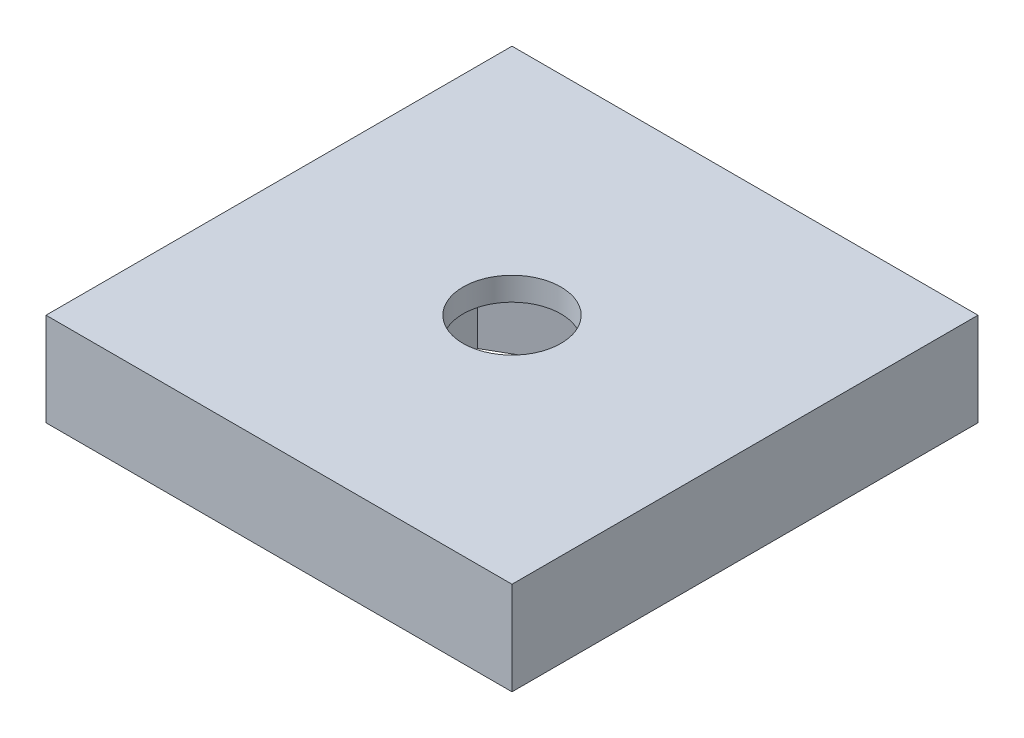
ISO-10303-21;
HEADER;
FILE_DESCRIPTION(('STEP AP214'),'2;1');
FILE_NAME('part.step','',(''),(''),'','','');
FILE_SCHEMA(('AUTOMOTIVE_DESIGN { 1 0 10303 214 1 1 1 1 }'));
ENDSEC;
DATA;
#1=APPLICATION_CONTEXT('core data for automotive mechanical design processes');
#2=APPLICATION_PROTOCOL_DEFINITION('international standard','automotive_design',2000,#1);
#3=PRODUCT_CONTEXT('',#1,'mechanical');
#4=PRODUCT('Part','Part','',(#3));
#5=PRODUCT_RELATED_PRODUCT_CATEGORY('part','',(#4));
#6=PRODUCT_DEFINITION_FORMATION('','',#4);
#7=PRODUCT_DEFINITION_CONTEXT('part definition',#1,'design');
#8=PRODUCT_DEFINITION('design','',#6,#7);
#9=PRODUCT_DEFINITION_SHAPE('','',#8);
#10=(LENGTH_UNIT() NAMED_UNIT(*) SI_UNIT(.MILLI.,.METRE.));
#11=(NAMED_UNIT(*) PLANE_ANGLE_UNIT() SI_UNIT($,.RADIAN.));
#12=(NAMED_UNIT(*) SI_UNIT($,.STERADIAN.) SOLID_ANGLE_UNIT());
#13=UNCERTAINTY_MEASURE_WITH_UNIT(LENGTH_MEASURE(1.E-05),#10,'distance_accuracy_value','');
#14=(GEOMETRIC_REPRESENTATION_CONTEXT(3) GLOBAL_UNCERTAINTY_ASSIGNED_CONTEXT((#13)) GLOBAL_UNIT_ASSIGNED_CONTEXT((#10,
#11,#12)) REPRESENTATION_CONTEXT('',''));
#15=CARTESIAN_POINT('',(0.,0.,0.));
#16=DIRECTION('',(0.,0.,1.));
#17=DIRECTION('',(1.,0.,0.));
#18=AXIS2_PLACEMENT_3D('',#15,#16,#17);
#19=CARTESIAN_POINT('',(0.,0.,0.));
#20=DIRECTION('',(0.,-1.,0.));
#21=DIRECTION('',(0.,0.,-1.));
#22=AXIS2_PLACEMENT_3D('',#19,#20,#21);
#23=PLANE('',#22);
#24=DIRECTION('',(0.,0.,-1.));
#25=VECTOR('',#24,1.);
#26=CARTESIAN_POINT('',(-10.,0.,10.));
#27=LINE('',#26,#25);
#28=CARTESIAN_POINT('',(-10.,0.,10.));
#29=VERTEX_POINT('',#28);
#30=CARTESIAN_POINT('',(-10.,0.,-10.));
#31=VERTEX_POINT('',#30);
#32=EDGE_CURVE('E149',#29,#31,#27,.T.);
#33=ORIENTED_EDGE('',*,*,#32,.T.);
#34=DIRECTION('',(1.,0.,0.));
#35=VECTOR('',#34,1.);
#36=CARTESIAN_POINT('',(-10.,0.,-10.));
#37=LINE('',#36,#35);
#38=CARTESIAN_POINT('',(10.,0.,-10.));
#39=VERTEX_POINT('',#38);
#40=EDGE_CURVE('E155',#31,#39,#37,.T.);
#41=ORIENTED_EDGE('',*,*,#40,.T.);
#42=DIRECTION('',(0.,0.,-1.));
#43=VECTOR('',#42,1.);
#44=CARTESIAN_POINT('',(10.,0.,10.));
#45=LINE('',#44,#43);
#46=CARTESIAN_POINT('',(10.,0.,10.));
#47=VERTEX_POINT('',#46);
#48=EDGE_CURVE('E177',#47,#39,#45,.T.);
#49=ORIENTED_EDGE('',*,*,#48,.F.);
#50=DIRECTION('',(1.,0.,0.));
#51=VECTOR('',#50,1.);
#52=CARTESIAN_POINT('',(-10.,0.,10.));
#53=LINE('',#52,#51);
#54=EDGE_CURVE('E165',#29,#47,#53,.T.);
#55=ORIENTED_EDGE('',*,*,#54,.F.);
#56=EDGE_LOOP('',(#33,#41,#49,#55));
#57=FACE_BOUND('',#56,.T.);
#58=DIRECTION('',(0.,0.,1.));
#59=VECTOR('',#58,1.);
#60=CARTESIAN_POINT('',(-3.50000000000001,0.,-2.02072594216368));
#61=LINE('',#60,#59);
#62=CARTESIAN_POINT('',(-3.50000000000001,0.,-2.02072594216368));
#63=VERTEX_POINT('',#62);
#64=CARTESIAN_POINT('',(-3.49999999999999,0.,2.02072594216371));
#65=VERTEX_POINT('',#64);
#66=EDGE_CURVE('E143',#63,#65,#61,.T.);
#67=ORIENTED_EDGE('',*,*,#66,.T.);
#68=DIRECTION('',(0.866025403784441,0.,0.499999999999995));
#69=VECTOR('',#68,1.);
#70=CARTESIAN_POINT('',(-3.49999999999999,0.,2.02072594216371));
#71=LINE('',#70,#69);
#72=CARTESIAN_POINT('',(0.,0.,4.04145188432738));
#73=VERTEX_POINT('',#72);
#74=EDGE_CURVE('E57',#65,#73,#71,.T.);
#75=ORIENTED_EDGE('',*,*,#74,.T.);
#76=DIRECTION('',(0.866025403784434,0.,-0.500000000000007));
#77=VECTOR('',#76,1.);
#78=CARTESIAN_POINT('',(0.,0.,4.04145188432738));
#79=LINE('',#78,#77);
#80=CARTESIAN_POINT('',(3.50000000000002,0.,2.02072594216366));
#81=VERTEX_POINT('',#80);
#82=EDGE_CURVE('E147',#73,#81,#79,.T.);
#83=ORIENTED_EDGE('',*,*,#82,.T.);
#84=DIRECTION('',(0.,0.,-1.));
#85=VECTOR('',#84,1.);
#86=CARTESIAN_POINT('',(3.50000000000002,0.,2.02072594216366));
#87=LINE('',#86,#85);
#88=CARTESIAN_POINT('',(3.49999999999998,0.,-2.02072594216373));
#89=VERTEX_POINT('',#88);
#90=EDGE_CURVE('E337',#81,#89,#87,.T.);
#91=ORIENTED_EDGE('',*,*,#90,.T.);
#92=DIRECTION('',(-0.866025403784442,0.,-0.499999999999995));
#93=VECTOR('',#92,1.);
#94=CARTESIAN_POINT('',(3.49999999999998,0.,-2.02072594216373));
#95=LINE('',#94,#93);
#96=CARTESIAN_POINT('',(0.,0.,-4.04145188432738));
#97=VERTEX_POINT('',#96);
#98=EDGE_CURVE('E341',#89,#97,#95,.T.);
#99=ORIENTED_EDGE('',*,*,#98,.T.);
#100=DIRECTION('',(-0.866025403784438,0.,0.500000000000001));
#101=VECTOR('',#100,1.);
#102=CARTESIAN_POINT('',(0.,0.,-4.04145188432738));
#103=LINE('',#102,#101);
#104=EDGE_CURVE('E345',#97,#63,#103,.T.);
#105=ORIENTED_EDGE('',*,*,#104,.T.);
#106=EDGE_LOOP('',(#67,#75,#83,#91,#99,#105));
#107=FACE_BOUND('',#106,.T.);
#108=ADVANCED_FACE('F39',(#57,#107),#23,.T.);
#109=CARTESIAN_POINT('',(-10.,4.,10.));
#110=DIRECTION('',(-1.,0.,0.));
#111=DIRECTION('',(0.,0.,1.));
#112=AXIS2_PLACEMENT_3D('',#109,#110,#111);
#113=PLANE('',#112);
#114=ORIENTED_EDGE('',*,*,#32,.F.);
#115=DIRECTION('',(0.,-1.,0.));
#116=VECTOR('',#115,1.);
#117=CARTESIAN_POINT('',(-10.,4.,10.));
#118=LINE('',#117,#116);
#119=CARTESIAN_POINT('',(-10.,4.,10.));
#120=VERTEX_POINT('',#119);
#121=EDGE_CURVE('E11',#120,#29,#118,.T.);
#122=ORIENTED_EDGE('',*,*,#121,.F.);
#123=DIRECTION('',(0.,0.,-1.));
#124=VECTOR('',#123,1.);
#125=CARTESIAN_POINT('',(-10.,4.,10.));
#126=LINE('',#125,#124);
#127=CARTESIAN_POINT('',(-10.,4.,-10.));
#128=VERTEX_POINT('',#127);
#129=EDGE_CURVE('E161',#120,#128,#126,.T.);
#130=ORIENTED_EDGE('',*,*,#129,.T.);
#131=DIRECTION('',(0.,-1.,0.));
#132=VECTOR('',#131,1.);
#133=CARTESIAN_POINT('',(-10.,4.,-10.));
#134=LINE('',#133,#132);
#135=EDGE_CURVE('E89',#128,#31,#134,.T.);
#136=ORIENTED_EDGE('',*,*,#135,.T.);
#137=EDGE_LOOP('',(#114,#122,#130,#136));
#138=FACE_BOUND('',#137,.T.);
#139=ADVANCED_FACE('F41',(#138),#113,.T.);
#140=CARTESIAN_POINT('',(-10.,4.,10.));
#141=DIRECTION('',(0.,0.,-1.));
#142=DIRECTION('',(-1.,0.,0.));
#143=AXIS2_PLACEMENT_3D('',#140,#141,#142);
#144=PLANE('',#143);
#145=ORIENTED_EDGE('',*,*,#54,.T.);
#146=DIRECTION('',(0.,-1.,0.));
#147=VECTOR('',#146,1.);
#148=CARTESIAN_POINT('',(10.,4.,10.));
#149=LINE('',#148,#147);
#150=CARTESIAN_POINT('',(10.,4.,10.));
#151=VERTEX_POINT('',#150);
#152=EDGE_CURVE('E49',#151,#47,#149,.T.);
#153=ORIENTED_EDGE('',*,*,#152,.F.);
#154=DIRECTION('',(1.,0.,0.));
#155=VECTOR('',#154,1.);
#156=CARTESIAN_POINT('',(-10.,4.,10.));
#157=LINE('',#156,#155);
#158=EDGE_CURVE('E171',#120,#151,#157,.T.);
#159=ORIENTED_EDGE('',*,*,#158,.F.);
#160=ORIENTED_EDGE('',*,*,#121,.T.);
#161=EDGE_LOOP('',(#145,#153,#159,#160));
#162=FACE_BOUND('',#161,.T.);
#163=ADVANCED_FACE('F196',(#162),#144,.F.);
#164=CARTESIAN_POINT('',(10.,4.,10.));
#165=DIRECTION('',(-1.,0.,0.));
#166=DIRECTION('',(0.,0.,1.));
#167=AXIS2_PLACEMENT_3D('',#164,#165,#166);
#168=PLANE('',#167);
#169=ORIENTED_EDGE('',*,*,#48,.T.);
#170=DIRECTION('',(0.,-1.,0.));
#171=VECTOR('',#170,1.);
#172=CARTESIAN_POINT('',(10.,4.,-10.));
#173=LINE('',#172,#171);
#174=CARTESIAN_POINT('',(10.,4.,-10.));
#175=VERTEX_POINT('',#174);
#176=EDGE_CURVE('E186',#175,#39,#173,.T.);
#177=ORIENTED_EDGE('',*,*,#176,.F.);
#178=DIRECTION('',(0.,0.,-1.));
#179=VECTOR('',#178,1.);
#180=CARTESIAN_POINT('',(10.,4.,10.));
#181=LINE('',#180,#179);
#182=EDGE_CURVE('E168',#151,#175,#181,.T.);
#183=ORIENTED_EDGE('',*,*,#182,.F.);
#184=ORIENTED_EDGE('',*,*,#152,.T.);
#185=EDGE_LOOP('',(#169,#177,#183,#184));
#186=FACE_BOUND('',#185,.T.);
#187=ADVANCED_FACE('F199',(#186),#168,.F.);
#188=CARTESIAN_POINT('',(-10.,4.,-10.));
#189=DIRECTION('',(0.,0.,-1.));
#190=DIRECTION('',(-1.,0.,0.));
#191=AXIS2_PLACEMENT_3D('',#188,#189,#190);
#192=PLANE('',#191);
#193=ORIENTED_EDGE('',*,*,#40,.F.);
#194=ORIENTED_EDGE('',*,*,#135,.F.);
#195=DIRECTION('',(1.,0.,0.));
#196=VECTOR('',#195,1.);
#197=CARTESIAN_POINT('',(-10.,4.,-10.));
#198=LINE('',#197,#196);
#199=EDGE_CURVE('E164',#128,#175,#198,.T.);
#200=ORIENTED_EDGE('',*,*,#199,.T.);
#201=ORIENTED_EDGE('',*,*,#176,.T.);
#202=EDGE_LOOP('',(#193,#194,#200,#201));
#203=FACE_BOUND('',#202,.T.);
#204=ADVANCED_FACE('F190',(#203),#192,.T.);
#205=CARTESIAN_POINT('',(0.,4.,0.));
#206=DIRECTION('',(0.,-1.,0.));
#207=DIRECTION('',(0.,0.,-1.));
#208=AXIS2_PLACEMENT_3D('',#205,#206,#207);
#209=PLANE('',#208);
#210=CARTESIAN_POINT('',(0.,4.,0.));
#211=DIRECTION('',(0.,1.,0.));
#212=DIRECTION('',(0.,0.,1.));
#213=AXIS2_PLACEMENT_3D('',#210,#211,#212);
#214=CIRCLE('',#213,2.1);
#215=CARTESIAN_POINT('',(0.,4.,2.1));
#216=VERTEX_POINT('',#215);
#217=EDGE_CURVE('E315',#216,#216,#214,.T.);
#218=ORIENTED_EDGE('',*,*,#217,.F.);
#219=EDGE_LOOP('',(#218));
#220=FACE_BOUND('',#219,.T.);
#221=ORIENTED_EDGE('',*,*,#129,.F.);
#222=ORIENTED_EDGE('',*,*,#158,.T.);
#223=ORIENTED_EDGE('',*,*,#182,.T.);
#224=ORIENTED_EDGE('',*,*,#199,.F.);
#225=EDGE_LOOP('',(#221,#222,#223,#224));
#226=FACE_BOUND('',#225,.T.);
#227=ADVANCED_FACE('F201',(#220,#226),#209,.F.);
#228=CARTESIAN_POINT('',(-3.49999999999999,3.,2.02072594216371));
#229=DIRECTION('',(0.499999999999995,0.,-0.866025403784442));
#230=DIRECTION('',(-0.866025403784442,0.,-0.499999999999995));
#231=AXIS2_PLACEMENT_3D('',#228,#229,#230);
#232=PLANE('',#231);
#233=ORIENTED_EDGE('',*,*,#74,.F.);
#234=DIRECTION('',(0.,-1.,0.));
#235=VECTOR('',#234,1.);
#236=CARTESIAN_POINT('',(-3.49999999999999,3.,2.02072594216371));
#237=LINE('',#236,#235);
#238=CARTESIAN_POINT('',(-3.49999999999999,3.,2.02072594216371));
#239=VERTEX_POINT('',#238);
#240=EDGE_CURVE('E141',#239,#65,#237,.T.);
#241=ORIENTED_EDGE('',*,*,#240,.F.);
#242=DIRECTION('',(0.866025403784441,0.,0.499999999999995));
#243=VECTOR('',#242,1.);
#244=CARTESIAN_POINT('',(-3.49999999999999,3.,2.02072594216371));
#245=LINE('',#244,#243);
#246=CARTESIAN_POINT('',(0.,3.,4.04145188432738));
#247=VERTEX_POINT('',#246);
#248=EDGE_CURVE('E131',#239,#247,#245,.T.);
#249=ORIENTED_EDGE('',*,*,#248,.T.);
#250=DIRECTION('',(0.,-1.,0.));
#251=VECTOR('',#250,1.);
#252=CARTESIAN_POINT('',(0.,3.,4.04145188432738));
#253=LINE('',#252,#251);
#254=EDGE_CURVE('E140',#247,#73,#253,.T.);
#255=ORIENTED_EDGE('',*,*,#254,.T.);
#256=EDGE_LOOP('',(#233,#241,#249,#255));
#257=FACE_BOUND('',#256,.T.);
#258=ADVANCED_FACE('F139',(#257),#232,.T.);
#259=CARTESIAN_POINT('',(0.,3.,4.04145188432738));
#260=DIRECTION('',(-0.500000000000007,0.,-0.866025403784435));
#261=DIRECTION('',(-0.866025403784434,0.,0.500000000000007));
#262=AXIS2_PLACEMENT_3D('',#259,#260,#261);
#263=PLANE('',#262);
#264=ORIENTED_EDGE('',*,*,#82,.F.);
#265=ORIENTED_EDGE('',*,*,#254,.F.);
#266=DIRECTION('',(0.866025403784434,0.,-0.500000000000007));
#267=VECTOR('',#266,1.);
#268=CARTESIAN_POINT('',(0.,3.,4.04145188432738));
#269=LINE('',#268,#267);
#270=CARTESIAN_POINT('',(3.50000000000002,3.,2.02072594216366));
#271=VERTEX_POINT('',#270);
#272=EDGE_CURVE('E127',#247,#271,#269,.T.);
#273=ORIENTED_EDGE('',*,*,#272,.T.);
#274=DIRECTION('',(0.,-1.,0.));
#275=VECTOR('',#274,1.);
#276=CARTESIAN_POINT('',(3.50000000000002,3.,2.02072594216366));
#277=LINE('',#276,#275);
#278=EDGE_CURVE('E150',#271,#81,#277,.T.);
#279=ORIENTED_EDGE('',*,*,#278,.T.);
#280=EDGE_LOOP('',(#264,#265,#273,#279));
#281=FACE_BOUND('',#280,.T.);
#282=ADVANCED_FACE('F145',(#281),#263,.T.);
#283=CARTESIAN_POINT('',(3.50000000000002,3.,2.02072594216366));
#284=DIRECTION('',(-1.,0.,0.));
#285=DIRECTION('',(0.,0.,1.));
#286=AXIS2_PLACEMENT_3D('',#283,#284,#285);
#287=PLANE('',#286);
#288=ORIENTED_EDGE('',*,*,#90,.F.);
#289=ORIENTED_EDGE('',*,*,#278,.F.);
#290=DIRECTION('',(0.,0.,-1.));
#291=VECTOR('',#290,1.);
#292=CARTESIAN_POINT('',(3.50000000000002,3.,2.02072594216366));
#293=LINE('',#292,#291);
#294=CARTESIAN_POINT('',(3.49999999999998,3.,-2.02072594216373));
#295=VERTEX_POINT('',#294);
#296=EDGE_CURVE('E133',#271,#295,#293,.T.);
#297=ORIENTED_EDGE('',*,*,#296,.T.);
#298=DIRECTION('',(0.,-1.,0.));
#299=VECTOR('',#298,1.);
#300=CARTESIAN_POINT('',(3.49999999999998,3.,-2.02072594216373));
#301=LINE('',#300,#299);
#302=EDGE_CURVE('E157',#295,#89,#301,.T.);
#303=ORIENTED_EDGE('',*,*,#302,.T.);
#304=EDGE_LOOP('',(#288,#289,#297,#303));
#305=FACE_BOUND('',#304,.T.);
#306=ADVANCED_FACE('F248',(#305),#287,.T.);
#307=CARTESIAN_POINT('',(3.49999999999998,3.,-2.02072594216373));
#308=DIRECTION('',(-0.499999999999995,0.,0.866025403784441));
#309=DIRECTION('',(0.866025403784442,0.,0.499999999999995));
#310=AXIS2_PLACEMENT_3D('',#307,#308,#309);
#311=PLANE('',#310);
#312=ORIENTED_EDGE('',*,*,#98,.F.);
#313=ORIENTED_EDGE('',*,*,#302,.F.);
#314=DIRECTION('',(-0.866025403784442,0.,-0.499999999999995));
#315=VECTOR('',#314,1.);
#316=CARTESIAN_POINT('',(3.49999999999998,3.,-2.02072594216373));
#317=LINE('',#316,#315);
#318=CARTESIAN_POINT('',(0.,3.,-4.04145188432738));
#319=VERTEX_POINT('',#318);
#320=EDGE_CURVE('E326',#295,#319,#317,.T.);
#321=ORIENTED_EDGE('',*,*,#320,.T.);
#322=DIRECTION('',(0.,-1.,0.));
#323=VECTOR('',#322,1.);
#324=CARTESIAN_POINT('',(0.,3.,-4.04145188432738));
#325=LINE('',#324,#323);
#326=EDGE_CURVE('E357',#319,#97,#325,.T.);
#327=ORIENTED_EDGE('',*,*,#326,.T.);
#328=EDGE_LOOP('',(#312,#313,#321,#327));
#329=FACE_BOUND('',#328,.T.);
#330=ADVANCED_FACE('F257',(#329),#311,.T.);
#331=CARTESIAN_POINT('',(0.,3.,-4.04145188432738));
#332=DIRECTION('',(0.500000000000001,0.,0.866025403784438));
#333=DIRECTION('',(0.866025403784438,0.,-0.500000000000001));
#334=AXIS2_PLACEMENT_3D('',#331,#332,#333);
#335=PLANE('',#334);
#336=ORIENTED_EDGE('',*,*,#104,.F.);
#337=ORIENTED_EDGE('',*,*,#326,.F.);
#338=DIRECTION('',(-0.866025403784438,0.,0.500000000000001));
#339=VECTOR('',#338,1.);
#340=CARTESIAN_POINT('',(0.,3.,-4.04145188432738));
#341=LINE('',#340,#339);
#342=CARTESIAN_POINT('',(-3.50000000000001,3.,-2.02072594216368));
#343=VERTEX_POINT('',#342);
#344=EDGE_CURVE('E329',#319,#343,#341,.T.);
#345=ORIENTED_EDGE('',*,*,#344,.T.);
#346=DIRECTION('',(0.,-1.,0.));
#347=VECTOR('',#346,1.);
#348=CARTESIAN_POINT('',(-3.50000000000001,3.,-2.02072594216368));
#349=LINE('',#348,#347);
#350=EDGE_CURVE('E354',#343,#63,#349,.T.);
#351=ORIENTED_EDGE('',*,*,#350,.T.);
#352=EDGE_LOOP('',(#336,#337,#345,#351));
#353=FACE_BOUND('',#352,.T.);
#354=ADVANCED_FACE('F267',(#353),#335,.T.);
#355=CARTESIAN_POINT('',(-3.50000000000001,3.,-2.02072594216368));
#356=DIRECTION('',(1.,0.,0.));
#357=DIRECTION('',(0.,0.,-1.));
#358=AXIS2_PLACEMENT_3D('',#355,#356,#357);
#359=PLANE('',#358);
#360=ORIENTED_EDGE('',*,*,#66,.F.);
#361=ORIENTED_EDGE('',*,*,#350,.F.);
#362=DIRECTION('',(0.,0.,1.));
#363=VECTOR('',#362,1.);
#364=CARTESIAN_POINT('',(-3.50000000000001,3.,-2.02072594216368));
#365=LINE('',#364,#363);
#366=EDGE_CURVE('E332',#343,#239,#365,.T.);
#367=ORIENTED_EDGE('',*,*,#366,.T.);
#368=ORIENTED_EDGE('',*,*,#240,.T.);
#369=EDGE_LOOP('',(#360,#361,#367,#368));
#370=FACE_BOUND('',#369,.T.);
#371=ADVANCED_FACE('F277',(#370),#359,.T.);
#372=CARTESIAN_POINT('',(0.,3.,0.));
#373=DIRECTION('',(0.,1.,0.));
#374=DIRECTION('',(0.,0.,1.));
#375=AXIS2_PLACEMENT_3D('',#372,#373,#374);
#376=PLANE('',#375);
#377=CARTESIAN_POINT('',(0.,3.,0.));
#378=DIRECTION('',(0.,1.,0.));
#379=DIRECTION('',(0.,0.,1.));
#380=AXIS2_PLACEMENT_3D('',#377,#378,#379);
#381=CIRCLE('',#380,2.1);
#382=CARTESIAN_POINT('',(0.,3.,2.1));
#383=VERTEX_POINT('',#382);
#384=EDGE_CURVE('E43',#383,#383,#381,.F.);
#385=ORIENTED_EDGE('',*,*,#384,.F.);
#386=EDGE_LOOP('',(#385));
#387=FACE_BOUND('',#386,.T.);
#388=ORIENTED_EDGE('',*,*,#248,.F.);
#389=ORIENTED_EDGE('',*,*,#366,.F.);
#390=ORIENTED_EDGE('',*,*,#344,.F.);
#391=ORIENTED_EDGE('',*,*,#320,.F.);
#392=ORIENTED_EDGE('',*,*,#296,.F.);
#393=ORIENTED_EDGE('',*,*,#272,.F.);
#394=EDGE_LOOP('',(#388,#389,#390,#391,#392,#393));
#395=FACE_BOUND('',#394,.T.);
#396=ADVANCED_FACE('F129',(#387,#395),#376,.F.);
#397=CARTESIAN_POINT('',(0.,4.,0.));
#398=DIRECTION('',(0.,-1.,0.));
#399=DIRECTION('',(0.,0.,-1.));
#400=AXIS2_PLACEMENT_3D('',#397,#398,#399);
#401=CYLINDRICAL_SURFACE('',#400,2.1);
#402=ORIENTED_EDGE('',*,*,#217,.T.);
#403=EDGE_LOOP('',(#402));
#404=FACE_BOUND('',#403,.T.);
#405=ORIENTED_EDGE('',*,*,#384,.T.);
#406=EDGE_LOOP('',(#405));
#407=FACE_BOUND('',#406,.T.);
#408=ADVANCED_FACE('F299',(#404,#407),#401,.F.);
#409=CLOSED_SHELL('',(#108,#139,#163,#187,#204,#227,#258,#282,#306,#330,#354,#371,#396,#408));
#410=MANIFOLD_SOLID_BREP('B2',#409);
#411=ADVANCED_BREP_SHAPE_REPRESENTATION('',(#18,#410),#14);
#412=SHAPE_DEFINITION_REPRESENTATION(#9,#411);
ENDSEC;
END-ISO-10303-21;
